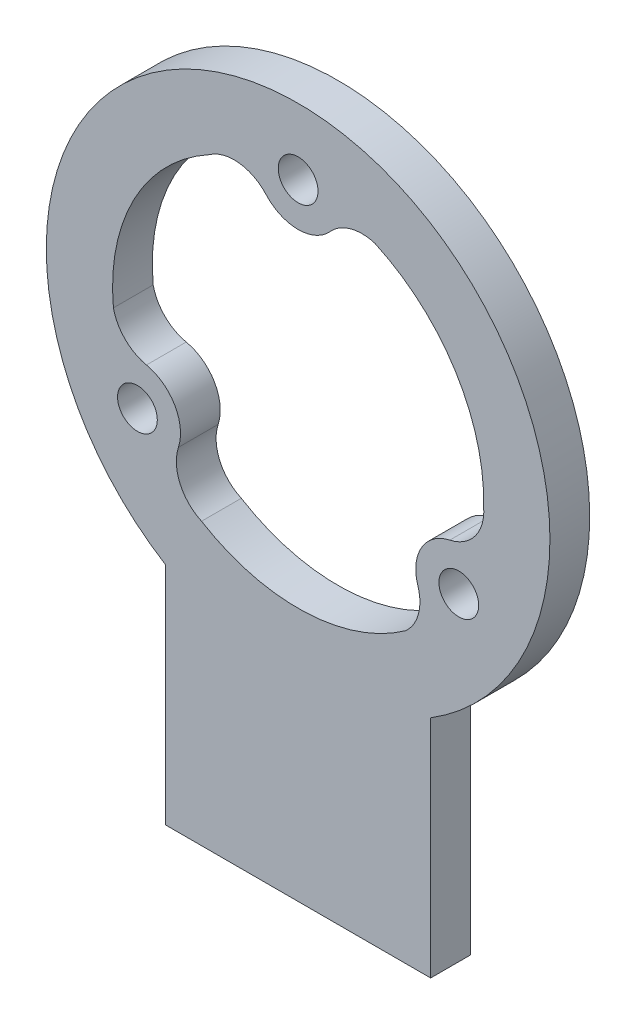
ISO-10303-21;
HEADER;
FILE_DESCRIPTION(('STEP AP214'),'2;1');
FILE_NAME('part.step','',(''),(''),'','','');
FILE_SCHEMA(('AUTOMOTIVE_DESIGN { 1 0 10303 214 1 1 1 1 }'));
ENDSEC;
DATA;
#1=APPLICATION_CONTEXT('core data for automotive mechanical design processes');
#2=APPLICATION_PROTOCOL_DEFINITION('international standard','automotive_design',2000,#1);
#3=PRODUCT_CONTEXT('',#1,'mechanical');
#4=PRODUCT('Part','Part','',(#3));
#5=PRODUCT_RELATED_PRODUCT_CATEGORY('part','',(#4));
#6=PRODUCT_DEFINITION_FORMATION('','',#4);
#7=PRODUCT_DEFINITION_CONTEXT('part definition',#1,'design');
#8=PRODUCT_DEFINITION('design','',#6,#7);
#9=PRODUCT_DEFINITION_SHAPE('','',#8);
#10=(LENGTH_UNIT() NAMED_UNIT(*) SI_UNIT(.MILLI.,.METRE.));
#11=(NAMED_UNIT(*) PLANE_ANGLE_UNIT() SI_UNIT($,.RADIAN.));
#12=(NAMED_UNIT(*) SI_UNIT($,.STERADIAN.) SOLID_ANGLE_UNIT());
#13=UNCERTAINTY_MEASURE_WITH_UNIT(LENGTH_MEASURE(1.E-05),#10,'distance_accuracy_value','');
#14=(GEOMETRIC_REPRESENTATION_CONTEXT(3) GLOBAL_UNCERTAINTY_ASSIGNED_CONTEXT((#13)) GLOBAL_UNIT_ASSIGNED_CONTEXT((#10,
#11,#12)) REPRESENTATION_CONTEXT('',''));
#15=CARTESIAN_POINT('',(0.,0.,0.));
#16=DIRECTION('',(0.,0.,1.));
#17=DIRECTION('',(1.,0.,0.));
#18=AXIS2_PLACEMENT_3D('',#15,#16,#17);
#19=CARTESIAN_POINT('',(0.,0.,3.));
#20=DIRECTION('',(0.,0.,1.));
#21=DIRECTION('',(1.,0.,0.));
#22=AXIS2_PLACEMENT_3D('',#19,#20,#21);
#23=PLANE('',#22);
#24=CARTESIAN_POINT('',(0.,0.,3.));
#25=DIRECTION('',(0.,0.,1.));
#26=DIRECTION('',(1.,0.,0.));
#27=AXIS2_PLACEMENT_3D('',#24,#25,#26);
#28=CIRCLE('',#27,14.);
#29=CARTESIAN_POINT('',(13.9959775932849,-0.335575935174573,3.));
#30=VERTEX_POINT('',#29);
#31=CARTESIAN_POINT('',(5.80943087987062,12.7377593340432,3.));
#32=VERTEX_POINT('',#31);
#33=EDGE_CURVE('E154',#30,#32,#28,.T.);
#34=ORIENTED_EDGE('',*,*,#33,.F.);
#35=CARTESIAN_POINT('',(10.7607074751454,-0.644650784804921,3.));
#36=DIRECTION('',(0.,0.,1.));
#37=DIRECTION('',(1.,0.,0.));
#38=AXIS2_PLACEMENT_3D('',#35,#36,#37);
#39=CIRCLE('',#38,3.25);
#40=CARTESIAN_POINT('',(11.4425315640637,-3.82232539240255,3.));
#41=VERTEX_POINT('',#40);
#42=EDGE_CURVE('E146',#41,#30,#39,.T.);
#43=ORIENTED_EDGE('',*,*,#42,.F.);
#44=CARTESIAN_POINT('',(12.124355652982,-7.00000000000017,3.));
#45=DIRECTION('',(0.,0.,-1.));
#46=DIRECTION('',(1.,0.,0.));
#47=AXIS2_PLACEMENT_3D('',#44,#45,#46);
#48=CIRCLE('',#47,3.25);
#49=CARTESIAN_POINT('',(9.03149667338257,-7.99836032188346,3.));
#50=VERTEX_POINT('',#49);
#51=EDGE_CURVE('E189',#50,#41,#48,.T.);
#52=ORIENTED_EDGE('',*,*,#51,.F.);
#53=CARTESIAN_POINT('',(5.93863769378309,-8.99672064376674,3.));
#54=DIRECTION('',(0.,0.,1.));
#55=DIRECTION('',(1.,0.,0.));
#56=AXIS2_PLACEMENT_3D('',#53,#54,#55);
#57=CIRCLE('',#56,3.25);
#58=CARTESIAN_POINT('',(8.12650773063849,-11.3999943905194,3.));
#59=VERTEX_POINT('',#58);
#60=EDGE_CURVE('E187',#59,#50,#57,.T.);
#61=ORIENTED_EDGE('',*,*,#60,.F.);
#62=CARTESIAN_POINT('',(0.,0.,3.));
#63=DIRECTION('',(0.,0.,1.));
#64=DIRECTION('',(1.,0.,0.));
#65=AXIS2_PLACEMENT_3D('',#62,#63,#64);
#66=CIRCLE('',#65,14.);
#67=CARTESIAN_POINT('',(-7.28860608140232,-11.9530841789952,3.));
#68=VERTEX_POINT('',#67);
#69=EDGE_CURVE('E185',#68,#59,#66,.T.);
#70=ORIENTED_EDGE('',*,*,#69,.F.);
#71=CARTESIAN_POINT('',(-5.93863769378334,-8.99672064376658,3.));
#72=DIRECTION('',(0.,0.,1.));
#73=DIRECTION('',(1.,0.,0.));
#74=AXIS2_PLACEMENT_3D('',#71,#72,#73);
#75=CIRCLE('',#74,3.25);
#76=CARTESIAN_POINT('',(-9.03149667338279,-7.9983603218832,3.));
#77=VERTEX_POINT('',#76);
#78=EDGE_CURVE('E183',#77,#68,#75,.T.);
#79=ORIENTED_EDGE('',*,*,#78,.F.);
#80=CARTESIAN_POINT('',(-12.1243556529822,-6.99999999999983,3.));
#81=DIRECTION('',(0.,0.,-1.));
#82=DIRECTION('',(1.,0.,0.));
#83=AXIS2_PLACEMENT_3D('',#80,#81,#82);
#84=CIRCLE('',#83,3.25);
#85=CARTESIAN_POINT('',(-11.4425315640638,-3.82232539240223,3.));
#86=VERTEX_POINT('',#85);
#87=EDGE_CURVE('E181',#86,#77,#84,.T.);
#88=ORIENTED_EDGE('',*,*,#87,.F.);
#89=CARTESIAN_POINT('',(-10.7607074751454,-0.644650784804622,3.));
#90=DIRECTION('',(0.,0.,1.));
#91=DIRECTION('',(1.,0.,0.));
#92=AXIS2_PLACEMENT_3D('',#89,#90,#91);
#93=CIRCLE('',#92,3.25);
#94=CARTESIAN_POINT('',(-13.9359386105091,-1.33776494352389,3.));
#95=VERTEX_POINT('',#94);
#96=EDGE_CURVE('E179',#95,#86,#93,.T.);
#97=ORIENTED_EDGE('',*,*,#96,.F.);
#98=CARTESIAN_POINT('',(0.,0.,3.));
#99=DIRECTION('',(0.,0.,1.));
#100=DIRECTION('',(1.,0.,0.));
#101=AXIS2_PLACEMENT_3D('',#98,#99,#100);
#102=CIRCLE('',#101,14.);
#103=CARTESIAN_POINT('',(-6.70737151188253,12.2886601141698,3.));
#104=VERTEX_POINT('',#103);
#105=EDGE_CURVE('E177',#104,#95,#102,.T.);
#106=ORIENTED_EDGE('',*,*,#105,.F.);
#107=CARTESIAN_POINT('',(-4.82206978136206,9.6413714285715,3.));
#108=DIRECTION('',(0.,0.,1.));
#109=DIRECTION('',(1.,0.,0.));
#110=AXIS2_PLACEMENT_3D('',#107,#108,#109);
#111=CIRCLE('',#110,3.25);
#112=CARTESIAN_POINT('',(-2.41103489068093,11.8206857142857,3.));
#113=VERTEX_POINT('',#112);
#114=EDGE_CURVE('E175',#113,#104,#111,.T.);
#115=ORIENTED_EDGE('',*,*,#114,.F.);
#116=CARTESIAN_POINT('',(2.06199684764E-13,14.,3.));
#117=DIRECTION('',(0.,0.,-1.));
#118=DIRECTION('',(1.,0.,0.));
#119=AXIS2_PLACEMENT_3D('',#116,#117,#118);
#120=CIRCLE('',#119,3.25);
#121=CARTESIAN_POINT('',(2.41103489068128,11.8206857142857,3.));
#122=VERTEX_POINT('',#121);
#123=EDGE_CURVE('E170',#122,#113,#120,.T.);
#124=ORIENTED_EDGE('',*,*,#123,.F.);
#125=CARTESIAN_POINT('',(4.82206978136234,9.64137142857136,3.));
#126=DIRECTION('',(0.,0.,1.));
#127=DIRECTION('',(1.,0.,0.));
#128=AXIS2_PLACEMENT_3D('',#125,#126,#127);
#129=CIRCLE('',#128,3.25);
#130=EDGE_CURVE('E168',#32,#122,#129,.T.);
#131=ORIENTED_EDGE('',*,*,#130,.F.);
#132=EDGE_LOOP('',(#34,#43,#52,#61,#70,#79,#88,#97,#106,#115,#124,#131));
#133=FACE_BOUND('',#132,.T.);
#134=CARTESIAN_POINT('',(12.124355652982,-7.00000000000017,3.));
#135=DIRECTION('',(0.,0.,1.));
#136=DIRECTION('',(1.,0.,0.));
#137=AXIS2_PLACEMENT_3D('',#134,#135,#136);
#138=CIRCLE('',#137,1.50000000000007);
#139=CARTESIAN_POINT('',(13.6243556529821,-7.00000000000017,3.));
#140=VERTEX_POINT('',#139);
#141=EDGE_CURVE('E242',#140,#140,#138,.T.);
#142=ORIENTED_EDGE('',*,*,#141,.F.);
#143=EDGE_LOOP('',(#142));
#144=FACE_BOUND('',#143,.T.);
#145=DIRECTION('',(0.,-1.,0.));
#146=VECTOR('',#145,1.);
#147=CARTESIAN_POINT('',(-10.0000000000001,-16.1554944214034,3.));
#148=LINE('',#147,#146);
#149=CARTESIAN_POINT('',(-10.0000000000001,-16.1554944214034,3.));
#150=VERTEX_POINT('',#149);
#151=CARTESIAN_POINT('',(-10.0000000000001,-33.1554944214036,3.));
#152=VERTEX_POINT('',#151);
#153=EDGE_CURVE('E254',#150,#152,#148,.T.);
#154=ORIENTED_EDGE('',*,*,#153,.T.);
#155=DIRECTION('',(1.,0.,0.));
#156=VECTOR('',#155,1.);
#157=CARTESIAN_POINT('',(9.9999999999999,-33.1554944214036,3.));
#158=LINE('',#157,#156);
#159=CARTESIAN_POINT('',(9.9999999999999,-33.1554944214036,3.));
#160=VERTEX_POINT('',#159);
#161=EDGE_CURVE('E257',#152,#160,#158,.T.);
#162=ORIENTED_EDGE('',*,*,#161,.T.);
#163=DIRECTION('',(0.,1.,0.));
#164=VECTOR('',#163,1.);
#165=CARTESIAN_POINT('',(9.9999999999999,-16.1554944214036,3.));
#166=LINE('',#165,#164);
#167=CARTESIAN_POINT('',(9.9999999999999,-16.1554944214036,3.));
#168=VERTEX_POINT('',#167);
#169=EDGE_CURVE('E260',#160,#168,#166,.T.);
#170=ORIENTED_EDGE('',*,*,#169,.T.);
#171=CARTESIAN_POINT('',(0.,0.,3.));
#172=DIRECTION('',(0.,0.,1.));
#173=DIRECTION('',(1.,0.,0.));
#174=AXIS2_PLACEMENT_3D('',#171,#172,#173);
#175=CIRCLE('',#174,19.);
#176=EDGE_CURVE('E262',#168,#150,#175,.T.);
#177=ORIENTED_EDGE('',*,*,#176,.T.);
#178=EDGE_LOOP('',(#154,#162,#170,#177));
#179=FACE_BOUND('',#178,.T.);
#180=CARTESIAN_POINT('',(2.06199684764E-13,14.,3.));
#181=DIRECTION('',(0.,0.,1.));
#182=DIRECTION('',(1.,0.,0.));
#183=AXIS2_PLACEMENT_3D('',#180,#181,#182);
#184=CIRCLE('',#183,1.5);
#185=CARTESIAN_POINT('',(1.5000000000002,14.,3.));
#186=VERTEX_POINT('',#185);
#187=EDGE_CURVE('E248',#186,#186,#184,.T.);
#188=ORIENTED_EDGE('',*,*,#187,.F.);
#189=EDGE_LOOP('',(#188));
#190=FACE_BOUND('',#189,.T.);
#191=CARTESIAN_POINT('',(-12.1243556529822,-6.99999999999983,3.));
#192=DIRECTION('',(0.,0.,1.));
#193=DIRECTION('',(1.,0.,0.));
#194=AXIS2_PLACEMENT_3D('',#191,#192,#193);
#195=CIRCLE('',#194,1.5);
#196=CARTESIAN_POINT('',(-10.6243556529822,-6.99999999999983,3.));
#197=VERTEX_POINT('',#196);
#198=EDGE_CURVE('E192',#197,#197,#195,.T.);
#199=ORIENTED_EDGE('',*,*,#198,.F.);
#200=EDGE_LOOP('',(#199));
#201=FACE_BOUND('',#200,.T.);
#202=ADVANCED_FACE('F33',(#133,#144,#179,#190,#201),#23,.T.);
#203=CARTESIAN_POINT('',(0.,0.,0.));
#204=DIRECTION('',(0.,0.,1.));
#205=DIRECTION('',(1.,0.,0.));
#206=AXIS2_PLACEMENT_3D('',#203,#204,#205);
#207=PLANE('',#206);
#208=CARTESIAN_POINT('',(12.124355652982,-7.00000000000017,0.));
#209=DIRECTION('',(0.,0.,1.));
#210=DIRECTION('',(1.,0.,0.));
#211=AXIS2_PLACEMENT_3D('',#208,#209,#210);
#212=CIRCLE('',#211,1.50000000000007);
#213=CARTESIAN_POINT('',(13.6243556529821,-7.00000000000017,0.));
#214=VERTEX_POINT('',#213);
#215=EDGE_CURVE('E162',#214,#214,#212,.T.);
#216=ORIENTED_EDGE('',*,*,#215,.T.);
#217=EDGE_LOOP('',(#216));
#218=FACE_BOUND('',#217,.T.);
#219=CARTESIAN_POINT('',(2.06199684764E-13,14.,0.));
#220=DIRECTION('',(0.,0.,1.));
#221=DIRECTION('',(1.,0.,0.));
#222=AXIS2_PLACEMENT_3D('',#219,#220,#221);
#223=CIRCLE('',#222,1.5);
#224=CARTESIAN_POINT('',(1.5000000000002,14.,0.));
#225=VERTEX_POINT('',#224);
#226=EDGE_CURVE('E245',#225,#225,#223,.T.);
#227=ORIENTED_EDGE('',*,*,#226,.T.);
#228=EDGE_LOOP('',(#227));
#229=FACE_BOUND('',#228,.T.);
#230=DIRECTION('',(0.,-1.,0.));
#231=VECTOR('',#230,1.);
#232=CARTESIAN_POINT('',(-10.0000000000001,-16.1554944214034,0.));
#233=LINE('',#232,#231);
#234=CARTESIAN_POINT('',(-10.0000000000001,-16.1554944214034,0.));
#235=VERTEX_POINT('',#234);
#236=CARTESIAN_POINT('',(-10.0000000000001,-33.1554944214036,0.));
#237=VERTEX_POINT('',#236);
#238=EDGE_CURVE('E251',#235,#237,#233,.T.);
#239=ORIENTED_EDGE('',*,*,#238,.F.);
#240=CARTESIAN_POINT('',(0.,0.,0.));
#241=DIRECTION('',(0.,0.,1.));
#242=DIRECTION('',(1.,0.,0.));
#243=AXIS2_PLACEMENT_3D('',#240,#241,#242);
#244=CIRCLE('',#243,19.);
#245=CARTESIAN_POINT('',(9.9999999999999,-16.1554944214036,0.));
#246=VERTEX_POINT('',#245);
#247=EDGE_CURVE('E258',#246,#235,#244,.T.);
#248=ORIENTED_EDGE('',*,*,#247,.F.);
#249=DIRECTION('',(0.,1.,0.));
#250=VECTOR('',#249,1.);
#251=CARTESIAN_POINT('',(9.9999999999999,-16.1554944214036,0.));
#252=LINE('',#251,#250);
#253=CARTESIAN_POINT('',(9.9999999999999,-33.1554944214036,0.));
#254=VERTEX_POINT('',#253);
#255=EDGE_CURVE('E269',#254,#246,#252,.T.);
#256=ORIENTED_EDGE('',*,*,#255,.F.);
#257=DIRECTION('',(1.,0.,0.));
#258=VECTOR('',#257,1.);
#259=CARTESIAN_POINT('',(9.9999999999999,-33.1554944214036,0.));
#260=LINE('',#259,#258);
#261=EDGE_CURVE('E267',#237,#254,#260,.T.);
#262=ORIENTED_EDGE('',*,*,#261,.F.);
#263=EDGE_LOOP('',(#239,#248,#256,#262));
#264=FACE_BOUND('',#263,.T.);
#265=CARTESIAN_POINT('',(10.7607074751454,-0.644650784804921,0.));
#266=DIRECTION('',(0.,0.,1.));
#267=DIRECTION('',(1.,0.,0.));
#268=AXIS2_PLACEMENT_3D('',#265,#266,#267);
#269=CIRCLE('',#268,3.25);
#270=CARTESIAN_POINT('',(11.4425315640637,-3.82232539240255,0.));
#271=VERTEX_POINT('',#270);
#272=CARTESIAN_POINT('',(13.9959775932849,-0.335575935174573,0.));
#273=VERTEX_POINT('',#272);
#274=EDGE_CURVE('E56',#271,#273,#269,.T.);
#275=ORIENTED_EDGE('',*,*,#274,.T.);
#276=CARTESIAN_POINT('',(0.,0.,0.));
#277=DIRECTION('',(0.,0.,1.));
#278=DIRECTION('',(1.,0.,0.));
#279=AXIS2_PLACEMENT_3D('',#276,#277,#278);
#280=CIRCLE('',#279,14.);
#281=CARTESIAN_POINT('',(5.80943087987062,12.7377593340432,0.));
#282=VERTEX_POINT('',#281);
#283=EDGE_CURVE('E161',#273,#282,#280,.T.);
#284=ORIENTED_EDGE('',*,*,#283,.T.);
#285=CARTESIAN_POINT('',(4.82206978136234,9.64137142857136,0.));
#286=DIRECTION('',(0.,0.,1.));
#287=DIRECTION('',(1.,0.,0.));
#288=AXIS2_PLACEMENT_3D('',#285,#286,#287);
#289=CIRCLE('',#288,3.25);
#290=CARTESIAN_POINT('',(2.41103489068128,11.8206857142857,0.));
#291=VERTEX_POINT('',#290);
#292=EDGE_CURVE('E194',#282,#291,#289,.T.);
#293=ORIENTED_EDGE('',*,*,#292,.T.);
#294=CARTESIAN_POINT('',(2.06199684764E-13,14.,0.));
#295=DIRECTION('',(0.,0.,-1.));
#296=DIRECTION('',(1.,0.,0.));
#297=AXIS2_PLACEMENT_3D('',#294,#295,#296);
#298=CIRCLE('',#297,3.25);
#299=CARTESIAN_POINT('',(-2.41103489068093,11.8206857142857,0.));
#300=VERTEX_POINT('',#299);
#301=EDGE_CURVE('E197',#291,#300,#298,.T.);
#302=ORIENTED_EDGE('',*,*,#301,.T.);
#303=CARTESIAN_POINT('',(-4.82206978136206,9.6413714285715,0.));
#304=DIRECTION('',(0.,0.,1.));
#305=DIRECTION('',(1.,0.,0.));
#306=AXIS2_PLACEMENT_3D('',#303,#304,#305);
#307=CIRCLE('',#306,3.25);
#308=CARTESIAN_POINT('',(-6.70737151188253,12.2886601141698,0.));
#309=VERTEX_POINT('',#308);
#310=EDGE_CURVE('E200',#300,#309,#307,.T.);
#311=ORIENTED_EDGE('',*,*,#310,.T.);
#312=CARTESIAN_POINT('',(0.,0.,0.));
#313=DIRECTION('',(0.,0.,1.));
#314=DIRECTION('',(1.,0.,0.));
#315=AXIS2_PLACEMENT_3D('',#312,#313,#314);
#316=CIRCLE('',#315,14.);
#317=CARTESIAN_POINT('',(-13.9359386105091,-1.33776494352389,0.));
#318=VERTEX_POINT('',#317);
#319=EDGE_CURVE('E203',#309,#318,#316,.T.);
#320=ORIENTED_EDGE('',*,*,#319,.T.);
#321=CARTESIAN_POINT('',(-10.7607074751454,-0.644650784804622,0.));
#322=DIRECTION('',(0.,0.,1.));
#323=DIRECTION('',(1.,0.,0.));
#324=AXIS2_PLACEMENT_3D('',#321,#322,#323);
#325=CIRCLE('',#324,3.25);
#326=CARTESIAN_POINT('',(-11.4425315640638,-3.82232539240223,0.));
#327=VERTEX_POINT('',#326);
#328=EDGE_CURVE('E206',#318,#327,#325,.T.);
#329=ORIENTED_EDGE('',*,*,#328,.T.);
#330=CARTESIAN_POINT('',(-12.1243556529822,-6.99999999999983,0.));
#331=DIRECTION('',(0.,0.,-1.));
#332=DIRECTION('',(1.,0.,0.));
#333=AXIS2_PLACEMENT_3D('',#330,#331,#332);
#334=CIRCLE('',#333,3.25);
#335=CARTESIAN_POINT('',(-9.03149667338279,-7.9983603218832,0.));
#336=VERTEX_POINT('',#335);
#337=EDGE_CURVE('E209',#327,#336,#334,.T.);
#338=ORIENTED_EDGE('',*,*,#337,.T.);
#339=CARTESIAN_POINT('',(-5.93863769378334,-8.99672064376658,0.));
#340=DIRECTION('',(0.,0.,1.));
#341=DIRECTION('',(1.,0.,0.));
#342=AXIS2_PLACEMENT_3D('',#339,#340,#341);
#343=CIRCLE('',#342,3.25);
#344=CARTESIAN_POINT('',(-7.28860608140232,-11.9530841789952,0.));
#345=VERTEX_POINT('',#344);
#346=EDGE_CURVE('E212',#336,#345,#343,.T.);
#347=ORIENTED_EDGE('',*,*,#346,.T.);
#348=CARTESIAN_POINT('',(0.,0.,0.));
#349=DIRECTION('',(0.,0.,1.));
#350=DIRECTION('',(1.,0.,0.));
#351=AXIS2_PLACEMENT_3D('',#348,#349,#350);
#352=CIRCLE('',#351,14.);
#353=CARTESIAN_POINT('',(8.12650773063849,-11.3999943905194,0.));
#354=VERTEX_POINT('',#353);
#355=EDGE_CURVE('E215',#345,#354,#352,.T.);
#356=ORIENTED_EDGE('',*,*,#355,.T.);
#357=CARTESIAN_POINT('',(5.93863769378309,-8.99672064376674,0.));
#358=DIRECTION('',(0.,0.,1.));
#359=DIRECTION('',(1.,0.,0.));
#360=AXIS2_PLACEMENT_3D('',#357,#358,#359);
#361=CIRCLE('',#360,3.25);
#362=CARTESIAN_POINT('',(9.03149667338257,-7.99836032188346,0.));
#363=VERTEX_POINT('',#362);
#364=EDGE_CURVE('E218',#354,#363,#361,.T.);
#365=ORIENTED_EDGE('',*,*,#364,.T.);
#366=CARTESIAN_POINT('',(12.124355652982,-7.00000000000017,0.));
#367=DIRECTION('',(0.,0.,-1.));
#368=DIRECTION('',(1.,0.,0.));
#369=AXIS2_PLACEMENT_3D('',#366,#367,#368);
#370=CIRCLE('',#369,3.25);
#371=EDGE_CURVE('E155',#363,#271,#370,.T.);
#372=ORIENTED_EDGE('',*,*,#371,.T.);
#373=EDGE_LOOP('',(#275,#284,#293,#302,#311,#320,#329,#338,#347,#356,#365,#372));
#374=FACE_BOUND('',#373,.T.);
#375=CARTESIAN_POINT('',(-12.1243556529822,-6.99999999999983,0.));
#376=DIRECTION('',(0.,0.,1.));
#377=DIRECTION('',(1.,0.,0.));
#378=AXIS2_PLACEMENT_3D('',#375,#376,#377);
#379=CIRCLE('',#378,1.5);
#380=CARTESIAN_POINT('',(-10.6243556529822,-6.99999999999983,0.));
#381=VERTEX_POINT('',#380);
#382=EDGE_CURVE('E334',#381,#381,#379,.T.);
#383=ORIENTED_EDGE('',*,*,#382,.T.);
#384=EDGE_LOOP('',(#383));
#385=FACE_BOUND('',#384,.T.);
#386=ADVANCED_FACE('F287',(#218,#229,#264,#374,#385),#207,.F.);
#387=CARTESIAN_POINT('',(-10.0000000000001,-16.1554944214034,3.));
#388=DIRECTION('',(1.,0.,0.));
#389=DIRECTION('',(0.,1.,0.));
#390=AXIS2_PLACEMENT_3D('',#387,#388,#389);
#391=PLANE('',#390);
#392=ORIENTED_EDGE('',*,*,#238,.T.);
#393=DIRECTION('',(0.,0.,-1.));
#394=VECTOR('',#393,1.);
#395=CARTESIAN_POINT('',(-10.0000000000001,-33.1554944214036,3.));
#396=LINE('',#395,#394);
#397=EDGE_CURVE('E11',#152,#237,#396,.T.);
#398=ORIENTED_EDGE('',*,*,#397,.F.);
#399=ORIENTED_EDGE('',*,*,#153,.F.);
#400=DIRECTION('',(0.,0.,-1.));
#401=VECTOR('',#400,1.);
#402=CARTESIAN_POINT('',(-10.0000000000001,-16.1554944214034,3.));
#403=LINE('',#402,#401);
#404=EDGE_CURVE('E264',#150,#235,#403,.T.);
#405=ORIENTED_EDGE('',*,*,#404,.T.);
#406=EDGE_LOOP('',(#392,#398,#399,#405));
#407=FACE_BOUND('',#406,.T.);
#408=ADVANCED_FACE('F35',(#407),#391,.F.);
#409=CARTESIAN_POINT('',(9.9999999999999,-33.1554944214036,3.));
#410=DIRECTION('',(0.,1.,0.));
#411=DIRECTION('',(0.,0.,1.));
#412=AXIS2_PLACEMENT_3D('',#409,#410,#411);
#413=PLANE('',#412);
#414=ORIENTED_EDGE('',*,*,#261,.T.);
#415=DIRECTION('',(0.,0.,-1.));
#416=VECTOR('',#415,1.);
#417=CARTESIAN_POINT('',(9.9999999999999,-33.1554944214036,3.));
#418=LINE('',#417,#416);
#419=EDGE_CURVE('E41',#160,#254,#418,.T.);
#420=ORIENTED_EDGE('',*,*,#419,.F.);
#421=ORIENTED_EDGE('',*,*,#161,.F.);
#422=ORIENTED_EDGE('',*,*,#397,.T.);
#423=EDGE_LOOP('',(#414,#420,#421,#422));
#424=FACE_BOUND('',#423,.T.);
#425=ADVANCED_FACE('F298',(#424),#413,.F.);
#426=CARTESIAN_POINT('',(9.9999999999999,-16.1554944214036,3.));
#427=DIRECTION('',(-1.,0.,0.));
#428=DIRECTION('',(0.,-1.,0.));
#429=AXIS2_PLACEMENT_3D('',#426,#427,#428);
#430=PLANE('',#429);
#431=ORIENTED_EDGE('',*,*,#255,.T.);
#432=DIRECTION('',(0.,0.,-1.));
#433=VECTOR('',#432,1.);
#434=CARTESIAN_POINT('',(9.9999999999999,-16.1554944214036,3.));
#435=LINE('',#434,#433);
#436=EDGE_CURVE('E274',#168,#246,#435,.T.);
#437=ORIENTED_EDGE('',*,*,#436,.F.);
#438=ORIENTED_EDGE('',*,*,#169,.F.);
#439=ORIENTED_EDGE('',*,*,#419,.T.);
#440=EDGE_LOOP('',(#431,#437,#438,#439));
#441=FACE_BOUND('',#440,.T.);
#442=ADVANCED_FACE('F281',(#441),#430,.F.);
#443=CARTESIAN_POINT('',(0.,0.,3.));
#444=DIRECTION('',(0.,0.,-1.));
#445=DIRECTION('',(-1.,0.,0.));
#446=AXIS2_PLACEMENT_3D('',#443,#444,#445);
#447=CYLINDRICAL_SURFACE('',#446,19.);
#448=ORIENTED_EDGE('',*,*,#247,.T.);
#449=ORIENTED_EDGE('',*,*,#404,.F.);
#450=ORIENTED_EDGE('',*,*,#176,.F.);
#451=ORIENTED_EDGE('',*,*,#436,.T.);
#452=EDGE_LOOP('',(#448,#449,#450,#451));
#453=FACE_BOUND('',#452,.T.);
#454=ADVANCED_FACE('F291',(#453),#447,.T.);
#455=CARTESIAN_POINT('',(2.06199684764E-13,14.,3.));
#456=DIRECTION('',(0.,0.,-1.));
#457=DIRECTION('',(-1.,0.,0.));
#458=AXIS2_PLACEMENT_3D('',#455,#456,#457);
#459=CYLINDRICAL_SURFACE('',#458,1.5);
#460=ORIENTED_EDGE('',*,*,#187,.T.);
#461=EDGE_LOOP('',(#460));
#462=FACE_BOUND('',#461,.T.);
#463=ORIENTED_EDGE('',*,*,#226,.F.);
#464=EDGE_LOOP('',(#463));
#465=FACE_BOUND('',#464,.T.);
#466=ADVANCED_FACE('F313',(#462,#465),#459,.F.);
#467=CARTESIAN_POINT('',(12.124355652982,-7.00000000000017,3.));
#468=DIRECTION('',(0.,0.,-1.));
#469=DIRECTION('',(-1.,0.,0.));
#470=AXIS2_PLACEMENT_3D('',#467,#468,#469);
#471=CYLINDRICAL_SURFACE('',#470,1.50000000000007);
#472=ORIENTED_EDGE('',*,*,#141,.T.);
#473=EDGE_LOOP('',(#472));
#474=FACE_BOUND('',#473,.T.);
#475=ORIENTED_EDGE('',*,*,#215,.F.);
#476=EDGE_LOOP('',(#475));
#477=FACE_BOUND('',#476,.T.);
#478=ADVANCED_FACE('F320',(#474,#477),#471,.F.);
#479=CARTESIAN_POINT('',(10.7607074751454,-0.644650784804921,3.));
#480=DIRECTION('',(0.,0.,-1.));
#481=DIRECTION('',(-1.,0.,0.));
#482=AXIS2_PLACEMENT_3D('',#479,#480,#481);
#483=CYLINDRICAL_SURFACE('',#482,3.25);
#484=ORIENTED_EDGE('',*,*,#274,.F.);
#485=DIRECTION('',(0.,0.,-1.));
#486=VECTOR('',#485,1.);
#487=CARTESIAN_POINT('',(11.4425315640637,-3.82232539240255,3.));
#488=LINE('',#487,#486);
#489=EDGE_CURVE('E150',#41,#271,#488,.T.);
#490=ORIENTED_EDGE('',*,*,#489,.F.);
#491=ORIENTED_EDGE('',*,*,#42,.T.);
#492=DIRECTION('',(0.,0.,-1.));
#493=VECTOR('',#492,1.);
#494=CARTESIAN_POINT('',(13.9959775932849,-0.335575935174573,3.));
#495=LINE('',#494,#493);
#496=EDGE_CURVE('E149',#30,#273,#495,.T.);
#497=ORIENTED_EDGE('',*,*,#496,.T.);
#498=EDGE_LOOP('',(#484,#490,#491,#497));
#499=FACE_BOUND('',#498,.T.);
#500=ADVANCED_FACE('F148',(#499),#483,.F.);
#501=CARTESIAN_POINT('',(0.,0.,3.));
#502=DIRECTION('',(0.,0.,-1.));
#503=DIRECTION('',(-1.,0.,0.));
#504=AXIS2_PLACEMENT_3D('',#501,#502,#503);
#505=CYLINDRICAL_SURFACE('',#504,14.);
#506=ORIENTED_EDGE('',*,*,#283,.F.);
#507=ORIENTED_EDGE('',*,*,#496,.F.);
#508=ORIENTED_EDGE('',*,*,#33,.T.);
#509=DIRECTION('',(0.,0.,-1.));
#510=VECTOR('',#509,1.);
#511=CARTESIAN_POINT('',(5.80943087987062,12.7377593340432,3.));
#512=LINE('',#511,#510);
#513=EDGE_CURVE('E163',#32,#282,#512,.T.);
#514=ORIENTED_EDGE('',*,*,#513,.T.);
#515=EDGE_LOOP('',(#506,#507,#508,#514));
#516=FACE_BOUND('',#515,.T.);
#517=ADVANCED_FACE('F158',(#516),#505,.F.);
#518=CARTESIAN_POINT('',(4.82206978136234,9.64137142857136,3.));
#519=DIRECTION('',(0.,0.,-1.));
#520=DIRECTION('',(-1.,0.,0.));
#521=AXIS2_PLACEMENT_3D('',#518,#519,#520);
#522=CYLINDRICAL_SURFACE('',#521,3.25);
#523=ORIENTED_EDGE('',*,*,#292,.F.);
#524=ORIENTED_EDGE('',*,*,#513,.F.);
#525=ORIENTED_EDGE('',*,*,#130,.T.);
#526=DIRECTION('',(0.,0.,-1.));
#527=VECTOR('',#526,1.);
#528=CARTESIAN_POINT('',(2.41103489068128,11.8206857142857,3.));
#529=LINE('',#528,#527);
#530=EDGE_CURVE('E239',#122,#291,#529,.T.);
#531=ORIENTED_EDGE('',*,*,#530,.T.);
#532=EDGE_LOOP('',(#523,#524,#525,#531));
#533=FACE_BOUND('',#532,.T.);
#534=ADVANCED_FACE('F380',(#533),#522,.F.);
#535=CARTESIAN_POINT('',(2.06199684764E-13,14.,3.));
#536=DIRECTION('',(0.,0.,-1.));
#537=DIRECTION('',(-1.,0.,0.));
#538=AXIS2_PLACEMENT_3D('',#535,#536,#537);
#539=CYLINDRICAL_SURFACE('',#538,3.25);
#540=ORIENTED_EDGE('',*,*,#301,.F.);
#541=ORIENTED_EDGE('',*,*,#530,.F.);
#542=ORIENTED_EDGE('',*,*,#123,.T.);
#543=DIRECTION('',(0.,0.,-1.));
#544=VECTOR('',#543,1.);
#545=CARTESIAN_POINT('',(-2.41103489068093,11.8206857142857,3.));
#546=LINE('',#545,#544);
#547=EDGE_CURVE('E237',#113,#300,#546,.T.);
#548=ORIENTED_EDGE('',*,*,#547,.T.);
#549=EDGE_LOOP('',(#540,#541,#542,#548));
#550=FACE_BOUND('',#549,.T.);
#551=ADVANCED_FACE('F376',(#550),#539,.T.);
#552=CARTESIAN_POINT('',(-4.82206978136206,9.6413714285715,3.));
#553=DIRECTION('',(0.,0.,-1.));
#554=DIRECTION('',(-1.,0.,0.));
#555=AXIS2_PLACEMENT_3D('',#552,#553,#554);
#556=CYLINDRICAL_SURFACE('',#555,3.25);
#557=ORIENTED_EDGE('',*,*,#310,.F.);
#558=ORIENTED_EDGE('',*,*,#547,.F.);
#559=ORIENTED_EDGE('',*,*,#114,.T.);
#560=DIRECTION('',(0.,0.,-1.));
#561=VECTOR('',#560,1.);
#562=CARTESIAN_POINT('',(-6.70737151188253,12.2886601141698,3.));
#563=LINE('',#562,#561);
#564=EDGE_CURVE('E235',#104,#309,#563,.T.);
#565=ORIENTED_EDGE('',*,*,#564,.T.);
#566=EDGE_LOOP('',(#557,#558,#559,#565));
#567=FACE_BOUND('',#566,.T.);
#568=ADVANCED_FACE('F372',(#567),#556,.F.);
#569=CARTESIAN_POINT('',(0.,0.,3.));
#570=DIRECTION('',(0.,0.,-1.));
#571=DIRECTION('',(-1.,0.,0.));
#572=AXIS2_PLACEMENT_3D('',#569,#570,#571);
#573=CYLINDRICAL_SURFACE('',#572,14.);
#574=ORIENTED_EDGE('',*,*,#319,.F.);
#575=ORIENTED_EDGE('',*,*,#564,.F.);
#576=ORIENTED_EDGE('',*,*,#105,.T.);
#577=DIRECTION('',(0.,0.,-1.));
#578=VECTOR('',#577,1.);
#579=CARTESIAN_POINT('',(-13.9359386105091,-1.33776494352389,3.));
#580=LINE('',#579,#578);
#581=EDGE_CURVE('E233',#95,#318,#580,.T.);
#582=ORIENTED_EDGE('',*,*,#581,.T.);
#583=EDGE_LOOP('',(#574,#575,#576,#582));
#584=FACE_BOUND('',#583,.T.);
#585=ADVANCED_FACE('F368',(#584),#573,.F.);
#586=CARTESIAN_POINT('',(-10.7607074751454,-0.644650784804622,3.));
#587=DIRECTION('',(0.,0.,-1.));
#588=DIRECTION('',(-1.,0.,0.));
#589=AXIS2_PLACEMENT_3D('',#586,#587,#588);
#590=CYLINDRICAL_SURFACE('',#589,3.25);
#591=ORIENTED_EDGE('',*,*,#328,.F.);
#592=ORIENTED_EDGE('',*,*,#581,.F.);
#593=ORIENTED_EDGE('',*,*,#96,.T.);
#594=DIRECTION('',(0.,0.,-1.));
#595=VECTOR('',#594,1.);
#596=CARTESIAN_POINT('',(-11.4425315640638,-3.82232539240223,3.));
#597=LINE('',#596,#595);
#598=EDGE_CURVE('E231',#86,#327,#597,.T.);
#599=ORIENTED_EDGE('',*,*,#598,.T.);
#600=EDGE_LOOP('',(#591,#592,#593,#599));
#601=FACE_BOUND('',#600,.T.);
#602=ADVANCED_FACE('F364',(#601),#590,.F.);
#603=CARTESIAN_POINT('',(-12.1243556529822,-6.99999999999983,3.));
#604=DIRECTION('',(0.,0.,-1.));
#605=DIRECTION('',(-1.,0.,0.));
#606=AXIS2_PLACEMENT_3D('',#603,#604,#605);
#607=CYLINDRICAL_SURFACE('',#606,3.25);
#608=ORIENTED_EDGE('',*,*,#337,.F.);
#609=ORIENTED_EDGE('',*,*,#598,.F.);
#610=ORIENTED_EDGE('',*,*,#87,.T.);
#611=DIRECTION('',(0.,0.,-1.));
#612=VECTOR('',#611,1.);
#613=CARTESIAN_POINT('',(-9.03149667338279,-7.9983603218832,3.));
#614=LINE('',#613,#612);
#615=EDGE_CURVE('E229',#77,#336,#614,.T.);
#616=ORIENTED_EDGE('',*,*,#615,.T.);
#617=EDGE_LOOP('',(#608,#609,#610,#616));
#618=FACE_BOUND('',#617,.T.);
#619=ADVANCED_FACE('F360',(#618),#607,.T.);
#620=CARTESIAN_POINT('',(-5.93863769378334,-8.99672064376658,3.));
#621=DIRECTION('',(0.,0.,-1.));
#622=DIRECTION('',(-1.,0.,0.));
#623=AXIS2_PLACEMENT_3D('',#620,#621,#622);
#624=CYLINDRICAL_SURFACE('',#623,3.25);
#625=ORIENTED_EDGE('',*,*,#346,.F.);
#626=ORIENTED_EDGE('',*,*,#615,.F.);
#627=ORIENTED_EDGE('',*,*,#78,.T.);
#628=DIRECTION('',(0.,0.,-1.));
#629=VECTOR('',#628,1.);
#630=CARTESIAN_POINT('',(-7.28860608140232,-11.9530841789952,3.));
#631=LINE('',#630,#629);
#632=EDGE_CURVE('E227',#68,#345,#631,.T.);
#633=ORIENTED_EDGE('',*,*,#632,.T.);
#634=EDGE_LOOP('',(#625,#626,#627,#633));
#635=FACE_BOUND('',#634,.T.);
#636=ADVANCED_FACE('F356',(#635),#624,.F.);
#637=CARTESIAN_POINT('',(0.,0.,3.));
#638=DIRECTION('',(0.,0.,-1.));
#639=DIRECTION('',(-1.,0.,0.));
#640=AXIS2_PLACEMENT_3D('',#637,#638,#639);
#641=CYLINDRICAL_SURFACE('',#640,14.);
#642=ORIENTED_EDGE('',*,*,#355,.F.);
#643=ORIENTED_EDGE('',*,*,#632,.F.);
#644=ORIENTED_EDGE('',*,*,#69,.T.);
#645=DIRECTION('',(0.,0.,-1.));
#646=VECTOR('',#645,1.);
#647=CARTESIAN_POINT('',(8.12650773063849,-11.3999943905194,3.));
#648=LINE('',#647,#646);
#649=EDGE_CURVE('E225',#59,#354,#648,.T.);
#650=ORIENTED_EDGE('',*,*,#649,.T.);
#651=EDGE_LOOP('',(#642,#643,#644,#650));
#652=FACE_BOUND('',#651,.T.);
#653=ADVANCED_FACE('F352',(#652),#641,.F.);
#654=CARTESIAN_POINT('',(5.93863769378309,-8.99672064376674,3.));
#655=DIRECTION('',(0.,0.,-1.));
#656=DIRECTION('',(-1.,0.,0.));
#657=AXIS2_PLACEMENT_3D('',#654,#655,#656);
#658=CYLINDRICAL_SURFACE('',#657,3.25);
#659=ORIENTED_EDGE('',*,*,#364,.F.);
#660=ORIENTED_EDGE('',*,*,#649,.F.);
#661=ORIENTED_EDGE('',*,*,#60,.T.);
#662=DIRECTION('',(0.,0.,-1.));
#663=VECTOR('',#662,1.);
#664=CARTESIAN_POINT('',(9.03149667338257,-7.99836032188346,3.));
#665=LINE('',#664,#663);
#666=EDGE_CURVE('E48',#50,#363,#665,.T.);
#667=ORIENTED_EDGE('',*,*,#666,.T.);
#668=EDGE_LOOP('',(#659,#660,#661,#667));
#669=FACE_BOUND('',#668,.T.);
#670=ADVANCED_FACE('F347',(#669),#658,.F.);
#671=CARTESIAN_POINT('',(12.124355652982,-7.00000000000017,3.));
#672=DIRECTION('',(0.,0.,-1.));
#673=DIRECTION('',(-1.,0.,0.));
#674=AXIS2_PLACEMENT_3D('',#671,#672,#673);
#675=CYLINDRICAL_SURFACE('',#674,3.25);
#676=ORIENTED_EDGE('',*,*,#371,.F.);
#677=ORIENTED_EDGE('',*,*,#666,.F.);
#678=ORIENTED_EDGE('',*,*,#51,.T.);
#679=ORIENTED_EDGE('',*,*,#489,.T.);
#680=EDGE_LOOP('',(#676,#677,#678,#679));
#681=FACE_BOUND('',#680,.T.);
#682=ADVANCED_FACE('F342',(#681),#675,.T.);
#683=CARTESIAN_POINT('',(-12.1243556529822,-6.99999999999983,3.));
#684=DIRECTION('',(0.,0.,-1.));
#685=DIRECTION('',(-1.,0.,0.));
#686=AXIS2_PLACEMENT_3D('',#683,#684,#685);
#687=CYLINDRICAL_SURFACE('',#686,1.5);
#688=ORIENTED_EDGE('',*,*,#198,.T.);
#689=EDGE_LOOP('',(#688));
#690=FACE_BOUND('',#689,.T.);
#691=ORIENTED_EDGE('',*,*,#382,.F.);
#692=EDGE_LOOP('',(#691));
#693=FACE_BOUND('',#692,.T.);
#694=ADVANCED_FACE('F340',(#690,#693),#687,.F.);
#695=CLOSED_SHELL('',(#202,#386,#408,#425,#442,#454,#466,#478,#500,#517,#534,#551,#568,#585,
#602,#619,#636,#653,#670,#682,#694));
#696=MANIFOLD_SOLID_BREP('B2',#695);
#697=ADVANCED_BREP_SHAPE_REPRESENTATION('',(#18,#696),#14);
#698=SHAPE_DEFINITION_REPRESENTATION(#9,#697);
ENDSEC;
END-ISO-10303-21;
